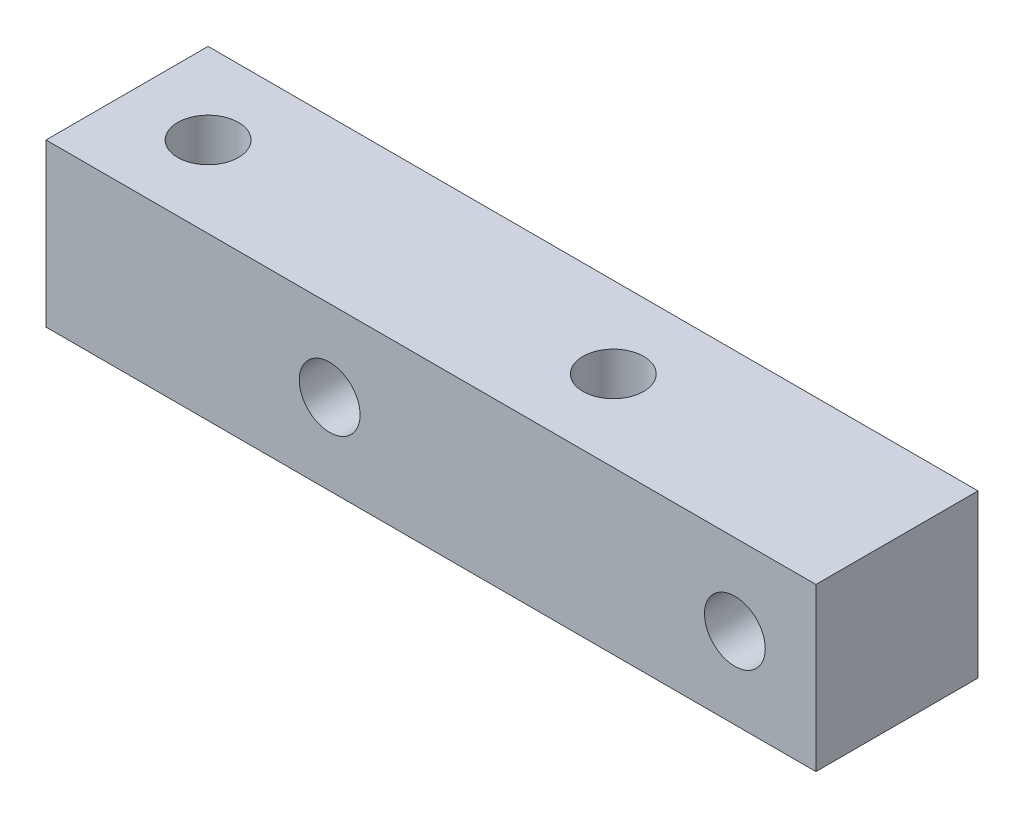
ISO-10303-21;
HEADER;
FILE_DESCRIPTION(('STEP AP214'),'2;1');
FILE_NAME('part.step','',(''),(''),'','','');
FILE_SCHEMA(('AUTOMOTIVE_DESIGN { 1 0 10303 214 1 1 1 1 }'));
ENDSEC;
DATA;
#1=APPLICATION_CONTEXT('core data for automotive mechanical design processes');
#2=APPLICATION_PROTOCOL_DEFINITION('international standard','automotive_design',2000,#1);
#3=PRODUCT_CONTEXT('',#1,'mechanical');
#4=PRODUCT('Part','Part','',(#3));
#5=PRODUCT_RELATED_PRODUCT_CATEGORY('part','',(#4));
#6=PRODUCT_DEFINITION_FORMATION('','',#4);
#7=PRODUCT_DEFINITION_CONTEXT('part definition',#1,'design');
#8=PRODUCT_DEFINITION('design','',#6,#7);
#9=PRODUCT_DEFINITION_SHAPE('','',#8);
#10=(LENGTH_UNIT() NAMED_UNIT(*) SI_UNIT(.MILLI.,.METRE.));
#11=(NAMED_UNIT(*) PLANE_ANGLE_UNIT() SI_UNIT($,.RADIAN.));
#12=(NAMED_UNIT(*) SI_UNIT($,.STERADIAN.) SOLID_ANGLE_UNIT());
#13=UNCERTAINTY_MEASURE_WITH_UNIT(LENGTH_MEASURE(1.E-05),#10,'distance_accuracy_value','');
#14=(GEOMETRIC_REPRESENTATION_CONTEXT(3) GLOBAL_UNCERTAINTY_ASSIGNED_CONTEXT((#13)) GLOBAL_UNIT_ASSIGNED_CONTEXT((#10,
#11,#12)) REPRESENTATION_CONTEXT('',''));
#15=CARTESIAN_POINT('',(0.,0.,0.));
#16=DIRECTION('',(0.,0.,1.));
#17=DIRECTION('',(1.,0.,0.));
#18=AXIS2_PLACEMENT_3D('',#15,#16,#17);
#19=CARTESIAN_POINT('',(0.,8.,0.));
#20=DIRECTION('',(0.,-1.,0.));
#21=DIRECTION('',(0.,0.,-1.));
#22=AXIS2_PLACEMENT_3D('',#19,#20,#21);
#23=PLANE('',#22);
#24=DIRECTION('',(0.,0.,-1.));
#25=VECTOR('',#24,1.);
#26=CARTESIAN_POINT('',(19.,8.,4.));
#27=LINE('',#26,#25);
#28=CARTESIAN_POINT('',(19.,8.,4.));
#29=VERTEX_POINT('',#28);
#30=CARTESIAN_POINT('',(19.,8.,-4.));
#31=VERTEX_POINT('',#30);
#32=EDGE_CURVE('E90',#29,#31,#27,.T.);
#33=ORIENTED_EDGE('',*,*,#32,.T.);
#34=DIRECTION('',(-1.,0.,0.));
#35=VECTOR('',#34,1.);
#36=CARTESIAN_POINT('',(-19.,8.,-4.));
#37=LINE('',#36,#35);
#38=CARTESIAN_POINT('',(-19.,8.,-4.));
#39=VERTEX_POINT('',#38);
#40=EDGE_CURVE('E85',#31,#39,#37,.T.);
#41=ORIENTED_EDGE('',*,*,#40,.T.);
#42=DIRECTION('',(0.,0.,1.));
#43=VECTOR('',#42,1.);
#44=CARTESIAN_POINT('',(-19.,8.,4.));
#45=LINE('',#44,#43);
#46=CARTESIAN_POINT('',(-19.,8.,4.));
#47=VERTEX_POINT('',#46);
#48=EDGE_CURVE('E88',#39,#47,#45,.T.);
#49=ORIENTED_EDGE('',*,*,#48,.T.);
#50=DIRECTION('',(1.,0.,0.));
#51=VECTOR('',#50,1.);
#52=CARTESIAN_POINT('',(-19.,8.,4.));
#53=LINE('',#52,#51);
#54=EDGE_CURVE('E55',#47,#29,#53,.T.);
#55=ORIENTED_EDGE('',*,*,#54,.T.);
#56=EDGE_LOOP('',(#33,#41,#49,#55));
#57=FACE_BOUND('',#56,.T.);
#58=CARTESIAN_POINT('',(-15.,8.,0.));
#59=DIRECTION('',(0.,1.,0.));
#60=DIRECTION('',(0.,0.,1.));
#61=AXIS2_PLACEMENT_3D('',#58,#59,#60);
#62=CIRCLE('',#61,1.5);
#63=CARTESIAN_POINT('',(-15.,8.,1.5));
#64=VERTEX_POINT('',#63);
#65=EDGE_CURVE('E105',#64,#64,#62,.T.);
#66=ORIENTED_EDGE('',*,*,#65,.F.);
#67=EDGE_LOOP('',(#66));
#68=FACE_BOUND('',#67,.T.);
#69=CARTESIAN_POINT('',(5.,8.,0.));
#70=DIRECTION('',(0.,1.,0.));
#71=DIRECTION('',(0.,0.,1.));
#72=AXIS2_PLACEMENT_3D('',#69,#70,#71);
#73=CIRCLE('',#72,1.5);
#74=CARTESIAN_POINT('',(5.,8.,1.5));
#75=VERTEX_POINT('',#74);
#76=EDGE_CURVE('E120',#75,#75,#73,.T.);
#77=ORIENTED_EDGE('',*,*,#76,.F.);
#78=EDGE_LOOP('',(#77));
#79=FACE_BOUND('',#78,.T.);
#80=ADVANCED_FACE('F38',(#57,#68,#79),#23,.F.);
#81=CARTESIAN_POINT('',(0.,0.,0.));
#82=DIRECTION('',(0.,-1.,0.));
#83=DIRECTION('',(0.,0.,-1.));
#84=AXIS2_PLACEMENT_3D('',#81,#82,#83);
#85=PLANE('',#84);
#86=CARTESIAN_POINT('',(-15.,0.,0.));
#87=DIRECTION('',(0.,1.,0.));
#88=DIRECTION('',(0.,0.,1.));
#89=AXIS2_PLACEMENT_3D('',#86,#87,#88);
#90=CIRCLE('',#89,1.5);
#91=CARTESIAN_POINT('',(-15.,0.,1.5));
#92=VERTEX_POINT('',#91);
#93=EDGE_CURVE('E117',#92,#92,#90,.T.);
#94=ORIENTED_EDGE('',*,*,#93,.T.);
#95=EDGE_LOOP('',(#94));
#96=FACE_BOUND('',#95,.T.);
#97=DIRECTION('',(0.,0.,-1.));
#98=VECTOR('',#97,1.);
#99=CARTESIAN_POINT('',(19.,0.,4.));
#100=LINE('',#99,#98);
#101=CARTESIAN_POINT('',(19.,0.,4.));
#102=VERTEX_POINT('',#101);
#103=CARTESIAN_POINT('',(19.,0.,-4.));
#104=VERTEX_POINT('',#103);
#105=EDGE_CURVE('E102',#102,#104,#100,.T.);
#106=ORIENTED_EDGE('',*,*,#105,.F.);
#107=DIRECTION('',(1.,0.,0.));
#108=VECTOR('',#107,1.);
#109=CARTESIAN_POINT('',(-19.,0.,4.));
#110=LINE('',#109,#108);
#111=CARTESIAN_POINT('',(-19.,0.,4.));
#112=VERTEX_POINT('',#111);
#113=EDGE_CURVE('E78',#112,#102,#110,.T.);
#114=ORIENTED_EDGE('',*,*,#113,.F.);
#115=DIRECTION('',(0.,0.,1.));
#116=VECTOR('',#115,1.);
#117=CARTESIAN_POINT('',(-19.,0.,4.));
#118=LINE('',#117,#116);
#119=CARTESIAN_POINT('',(-19.,0.,-4.));
#120=VERTEX_POINT('',#119);
#121=EDGE_CURVE('E72',#120,#112,#118,.T.);
#122=ORIENTED_EDGE('',*,*,#121,.F.);
#123=DIRECTION('',(-1.,0.,0.));
#124=VECTOR('',#123,1.);
#125=CARTESIAN_POINT('',(-19.,0.,-4.));
#126=LINE('',#125,#124);
#127=EDGE_CURVE('E94',#104,#120,#126,.T.);
#128=ORIENTED_EDGE('',*,*,#127,.F.);
#129=EDGE_LOOP('',(#106,#114,#122,#128));
#130=FACE_BOUND('',#129,.T.);
#131=CARTESIAN_POINT('',(5.,0.,0.));
#132=DIRECTION('',(0.,1.,0.));
#133=DIRECTION('',(0.,0.,1.));
#134=AXIS2_PLACEMENT_3D('',#131,#132,#133);
#135=CIRCLE('',#134,1.5);
#136=CARTESIAN_POINT('',(5.,0.,1.5));
#137=VERTEX_POINT('',#136);
#138=EDGE_CURVE('E123',#137,#137,#135,.T.);
#139=ORIENTED_EDGE('',*,*,#138,.T.);
#140=EDGE_LOOP('',(#139));
#141=FACE_BOUND('',#140,.T.);
#142=ADVANCED_FACE('F113',(#96,#130,#141),#85,.T.);
#143=CARTESIAN_POINT('',(19.,8.,4.));
#144=DIRECTION('',(-1.,0.,0.));
#145=DIRECTION('',(0.,0.,1.));
#146=AXIS2_PLACEMENT_3D('',#143,#144,#145);
#147=PLANE('',#146);
#148=ORIENTED_EDGE('',*,*,#105,.T.);
#149=DIRECTION('',(0.,-1.,0.));
#150=VECTOR('',#149,1.);
#151=CARTESIAN_POINT('',(19.,8.,-4.));
#152=LINE('',#151,#150);
#153=EDGE_CURVE('E11',#31,#104,#152,.T.);
#154=ORIENTED_EDGE('',*,*,#153,.F.);
#155=ORIENTED_EDGE('',*,*,#32,.F.);
#156=DIRECTION('',(0.,-1.,0.));
#157=VECTOR('',#156,1.);
#158=CARTESIAN_POINT('',(19.,8.,4.));
#159=LINE('',#158,#157);
#160=EDGE_CURVE('E98',#29,#102,#159,.T.);
#161=ORIENTED_EDGE('',*,*,#160,.T.);
#162=EDGE_LOOP('',(#148,#154,#155,#161));
#163=FACE_BOUND('',#162,.T.);
#164=ADVANCED_FACE('F40',(#163),#147,.F.);
#165=CARTESIAN_POINT('',(-19.,8.,-4.));
#166=DIRECTION('',(0.,0.,1.));
#167=DIRECTION('',(1.,0.,0.));
#168=AXIS2_PLACEMENT_3D('',#165,#166,#167);
#169=PLANE('',#168);
#170=CARTESIAN_POINT('',(-5.,4.,-4.));
#171=DIRECTION('',(0.,0.,1.));
#172=DIRECTION('',(1.,0.,0.));
#173=AXIS2_PLACEMENT_3D('',#170,#171,#172);
#174=CIRCLE('',#173,1.5);
#175=CARTESIAN_POINT('',(-3.5,4.,-4.));
#176=VERTEX_POINT('',#175);
#177=EDGE_CURVE('E126',#176,#176,#174,.T.);
#178=ORIENTED_EDGE('',*,*,#177,.T.);
#179=EDGE_LOOP('',(#178));
#180=FACE_BOUND('',#179,.T.);
#181=CARTESIAN_POINT('',(15.,4.,-4.));
#182=DIRECTION('',(0.,0.,1.));
#183=DIRECTION('',(1.,0.,0.));
#184=AXIS2_PLACEMENT_3D('',#181,#182,#183);
#185=CIRCLE('',#184,1.5);
#186=CARTESIAN_POINT('',(16.5,4.,-4.));
#187=VERTEX_POINT('',#186);
#188=EDGE_CURVE('E132',#187,#187,#185,.T.);
#189=ORIENTED_EDGE('',*,*,#188,.T.);
#190=EDGE_LOOP('',(#189));
#191=FACE_BOUND('',#190,.T.);
#192=ORIENTED_EDGE('',*,*,#127,.T.);
#193=DIRECTION('',(0.,-1.,0.));
#194=VECTOR('',#193,1.);
#195=CARTESIAN_POINT('',(-19.,8.,-4.));
#196=LINE('',#195,#194);
#197=EDGE_CURVE('E47',#39,#120,#196,.T.);
#198=ORIENTED_EDGE('',*,*,#197,.F.);
#199=ORIENTED_EDGE('',*,*,#40,.F.);
#200=ORIENTED_EDGE('',*,*,#153,.T.);
#201=EDGE_LOOP('',(#192,#198,#199,#200));
#202=FACE_BOUND('',#201,.T.);
#203=ADVANCED_FACE('F93',(#180,#191,#202),#169,.F.);
#204=CARTESIAN_POINT('',(-19.,8.,4.));
#205=DIRECTION('',(1.,0.,0.));
#206=DIRECTION('',(0.,0.,-1.));
#207=AXIS2_PLACEMENT_3D('',#204,#205,#206);
#208=PLANE('',#207);
#209=ORIENTED_EDGE('',*,*,#121,.T.);
#210=DIRECTION('',(0.,-1.,0.));
#211=VECTOR('',#210,1.);
#212=CARTESIAN_POINT('',(-19.,8.,4.));
#213=LINE('',#212,#211);
#214=EDGE_CURVE('E95',#47,#112,#213,.T.);
#215=ORIENTED_EDGE('',*,*,#214,.F.);
#216=ORIENTED_EDGE('',*,*,#48,.F.);
#217=ORIENTED_EDGE('',*,*,#197,.T.);
#218=EDGE_LOOP('',(#209,#215,#216,#217));
#219=FACE_BOUND('',#218,.T.);
#220=ADVANCED_FACE('F96',(#219),#208,.F.);
#221=CARTESIAN_POINT('',(-19.,8.,4.));
#222=DIRECTION('',(0.,0.,-1.));
#223=DIRECTION('',(-1.,0.,0.));
#224=AXIS2_PLACEMENT_3D('',#221,#222,#223);
#225=PLANE('',#224);
#226=CARTESIAN_POINT('',(-5.,4.,4.));
#227=DIRECTION('',(0.,0.,1.));
#228=DIRECTION('',(1.,0.,0.));
#229=AXIS2_PLACEMENT_3D('',#226,#227,#228);
#230=CIRCLE('',#229,1.5);
#231=CARTESIAN_POINT('',(-3.5,4.,4.));
#232=VERTEX_POINT('',#231);
#233=EDGE_CURVE('E135',#232,#232,#230,.T.);
#234=ORIENTED_EDGE('',*,*,#233,.F.);
#235=EDGE_LOOP('',(#234));
#236=FACE_BOUND('',#235,.T.);
#237=CARTESIAN_POINT('',(15.,4.,4.));
#238=DIRECTION('',(0.,0.,1.));
#239=DIRECTION('',(1.,0.,0.));
#240=AXIS2_PLACEMENT_3D('',#237,#238,#239);
#241=CIRCLE('',#240,1.5);
#242=CARTESIAN_POINT('',(16.5,4.,4.));
#243=VERTEX_POINT('',#242);
#244=EDGE_CURVE('E129',#243,#243,#241,.T.);
#245=ORIENTED_EDGE('',*,*,#244,.F.);
#246=EDGE_LOOP('',(#245));
#247=FACE_BOUND('',#246,.T.);
#248=ORIENTED_EDGE('',*,*,#113,.T.);
#249=ORIENTED_EDGE('',*,*,#160,.F.);
#250=ORIENTED_EDGE('',*,*,#54,.F.);
#251=ORIENTED_EDGE('',*,*,#214,.T.);
#252=EDGE_LOOP('',(#248,#249,#250,#251));
#253=FACE_BOUND('',#252,.T.);
#254=ADVANCED_FACE('F110',(#236,#247,#253),#225,.F.);
#255=CARTESIAN_POINT('',(-15.,8.,0.));
#256=DIRECTION('',(0.,-1.,0.));
#257=DIRECTION('',(0.,0.,-1.));
#258=AXIS2_PLACEMENT_3D('',#255,#256,#257);
#259=CYLINDRICAL_SURFACE('',#258,1.5);
#260=ORIENTED_EDGE('',*,*,#65,.T.);
#261=EDGE_LOOP('',(#260));
#262=FACE_BOUND('',#261,.T.);
#263=ORIENTED_EDGE('',*,*,#93,.F.);
#264=EDGE_LOOP('',(#263));
#265=FACE_BOUND('',#264,.T.);
#266=ADVANCED_FACE('F152',(#262,#265),#259,.F.);
#267=CARTESIAN_POINT('',(5.,8.,0.));
#268=DIRECTION('',(0.,-1.,0.));
#269=DIRECTION('',(0.,0.,-1.));
#270=AXIS2_PLACEMENT_3D('',#267,#268,#269);
#271=CYLINDRICAL_SURFACE('',#270,1.5);
#272=ORIENTED_EDGE('',*,*,#76,.T.);
#273=EDGE_LOOP('',(#272));
#274=FACE_BOUND('',#273,.T.);
#275=ORIENTED_EDGE('',*,*,#138,.F.);
#276=EDGE_LOOP('',(#275));
#277=FACE_BOUND('',#276,.T.);
#278=ADVANCED_FACE('F157',(#274,#277),#271,.F.);
#279=CARTESIAN_POINT('',(15.,4.,-4.));
#280=DIRECTION('',(0.,0.,1.));
#281=DIRECTION('',(1.,0.,0.));
#282=AXIS2_PLACEMENT_3D('',#279,#280,#281);
#283=CYLINDRICAL_SURFACE('',#282,1.5);
#284=ORIENTED_EDGE('',*,*,#188,.F.);
#285=EDGE_LOOP('',(#284));
#286=FACE_BOUND('',#285,.T.);
#287=ORIENTED_EDGE('',*,*,#244,.T.);
#288=EDGE_LOOP('',(#287));
#289=FACE_BOUND('',#288,.T.);
#290=ADVANCED_FACE('F146',(#286,#289),#283,.F.);
#291=CARTESIAN_POINT('',(-5.,4.,-4.));
#292=DIRECTION('',(0.,0.,1.));
#293=DIRECTION('',(1.,0.,0.));
#294=AXIS2_PLACEMENT_3D('',#291,#292,#293);
#295=CYLINDRICAL_SURFACE('',#294,1.5);
#296=ORIENTED_EDGE('',*,*,#177,.F.);
#297=EDGE_LOOP('',(#296));
#298=FACE_BOUND('',#297,.T.);
#299=ORIENTED_EDGE('',*,*,#233,.T.);
#300=EDGE_LOOP('',(#299));
#301=FACE_BOUND('',#300,.T.);
#302=ADVANCED_FACE('F143',(#298,#301),#295,.F.);
#303=CLOSED_SHELL('',(#80,#142,#164,#203,#220,#254,#266,#278,#290,#302));
#304=MANIFOLD_SOLID_BREP('B2',#303);
#305=ADVANCED_BREP_SHAPE_REPRESENTATION('',(#18,#304),#14);
#306=SHAPE_DEFINITION_REPRESENTATION(#9,#305);
ENDSEC;
END-ISO-10303-21;
